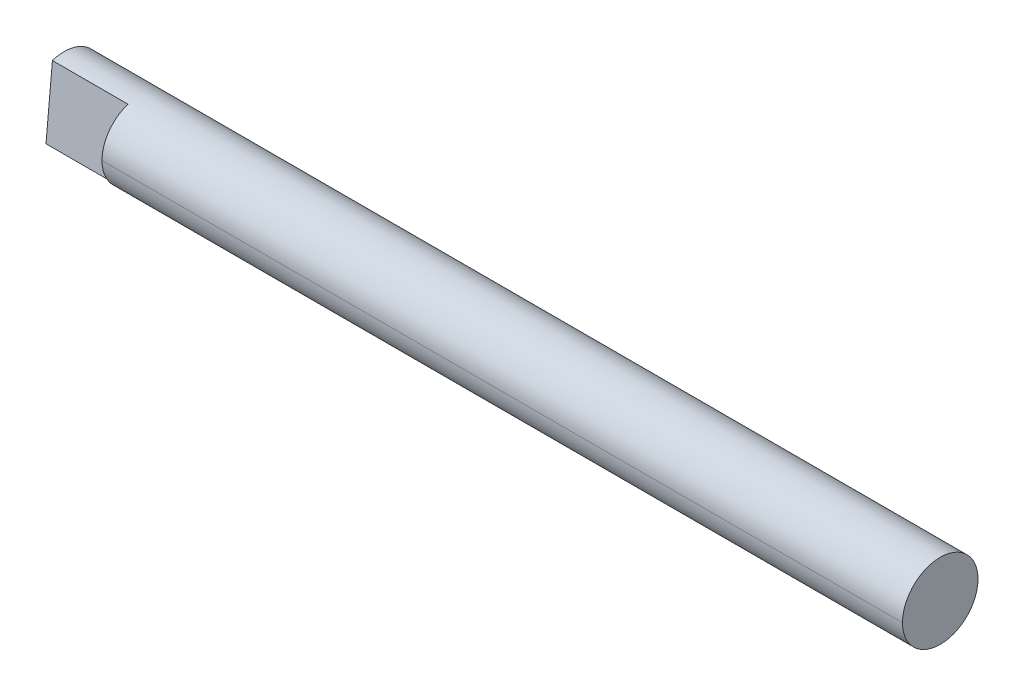
ISO-10303-21;
HEADER;
FILE_DESCRIPTION(('STEP AP214'),'2;1');
FILE_NAME('part.step','',(''),(''),'','','');
FILE_SCHEMA(('AUTOMOTIVE_DESIGN { 1 0 10303 214 1 1 1 1 }'));
ENDSEC;
DATA;
#1=APPLICATION_CONTEXT('core data for automotive mechanical design processes');
#2=APPLICATION_PROTOCOL_DEFINITION('international standard','automotive_design',2000,#1);
#3=PRODUCT_CONTEXT('',#1,'mechanical');
#4=PRODUCT('Part','Part','',(#3));
#5=PRODUCT_RELATED_PRODUCT_CATEGORY('part','',(#4));
#6=PRODUCT_DEFINITION_FORMATION('','',#4);
#7=PRODUCT_DEFINITION_CONTEXT('part definition',#1,'design');
#8=PRODUCT_DEFINITION('design','',#6,#7);
#9=PRODUCT_DEFINITION_SHAPE('','',#8);
#10=(LENGTH_UNIT() NAMED_UNIT(*) SI_UNIT(.MILLI.,.METRE.));
#11=(NAMED_UNIT(*) PLANE_ANGLE_UNIT() SI_UNIT($,.RADIAN.));
#12=(NAMED_UNIT(*) SI_UNIT($,.STERADIAN.) SOLID_ANGLE_UNIT());
#13=UNCERTAINTY_MEASURE_WITH_UNIT(LENGTH_MEASURE(1.E-05),#10,'distance_accuracy_value','');
#14=(GEOMETRIC_REPRESENTATION_CONTEXT(3) GLOBAL_UNCERTAINTY_ASSIGNED_CONTEXT((#13)) GLOBAL_UNIT_ASSIGNED_CONTEXT((#10,
#11,#12)) REPRESENTATION_CONTEXT('',''));
#15=CARTESIAN_POINT('',(0.,0.,0.));
#16=DIRECTION('',(0.,0.,1.));
#17=DIRECTION('',(1.,0.,0.));
#18=AXIS2_PLACEMENT_3D('',#15,#16,#17);
#19=CARTESIAN_POINT('',(600.,0.,0.));
#20=DIRECTION('',(1.,0.,0.));
#21=DIRECTION('',(0.,-1.,0.));
#22=AXIS2_PLACEMENT_3D('',#19,#20,#21);
#23=CYLINDRICAL_SURFACE('',#22,5.);
#24=DIRECTION('',(-1.,0.,0.));
#25=VECTOR('',#24,1.);
#26=CARTESIAN_POINT('',(10.,4.74769141742648,1.56825578426922));
#27=LINE('',#26,#25);
#28=CARTESIAN_POINT('',(10.,4.74769141742648,1.56825578426922));
#29=VERTEX_POINT('',#28);
#30=CARTESIAN_POINT('',(0.,4.74769141742658,1.56825578426926));
#31=VERTEX_POINT('',#30);
#32=EDGE_CURVE('E59',#29,#31,#27,.T.);
#33=ORIENTED_EDGE('',*,*,#32,.F.);
#34=CARTESIAN_POINT('',(10.,0.,0.));
#35=DIRECTION('',(-1.,0.,0.));
#36=DIRECTION('',(0.,0.,1.));
#37=AXIS2_PLACEMENT_3D('',#34,#35,#36);
#38=CIRCLE('',#37,5.);
#39=CARTESIAN_POINT('',(10.,0.,5.));
#40=VERTEX_POINT('',#39);
#41=EDGE_CURVE('E85',#40,#29,#38,.T.);
#42=ORIENTED_EDGE('',*,*,#41,.F.);
#43=DIRECTION('',(1.,0.,0.));
#44=VECTOR('',#43,1.);
#45=CARTESIAN_POINT('',(0.,0.,5.));
#46=LINE('',#45,#44);
#47=CARTESIAN_POINT('',(116.,0.,5.));
#48=VERTEX_POINT('',#47);
#49=EDGE_CURVE('E46',#40,#48,#46,.T.);
#50=ORIENTED_EDGE('',*,*,#49,.T.);
#51=CARTESIAN_POINT('',(116.,0.,0.));
#52=DIRECTION('',(1.,0.,0.));
#53=DIRECTION('',(0.,0.,-1.));
#54=AXIS2_PLACEMENT_3D('',#51,#52,#53);
#55=CIRCLE('',#54,5.);
#56=CARTESIAN_POINT('',(116.,0.,-5.));
#57=VERTEX_POINT('',#56);
#58=EDGE_CURVE('E104',#57,#48,#55,.T.);
#59=ORIENTED_EDGE('',*,*,#58,.F.);
#60=DIRECTION('',(1.,0.,0.));
#61=VECTOR('',#60,1.);
#62=CARTESIAN_POINT('',(0.,0.,-5.));
#63=LINE('',#62,#61);
#64=CARTESIAN_POINT('',(0.,0.,-5.));
#65=VERTEX_POINT('',#64);
#66=EDGE_CURVE('E106',#65,#57,#63,.T.);
#67=ORIENTED_EDGE('',*,*,#66,.F.);
#68=CARTESIAN_POINT('',(0.,0.,0.));
#69=DIRECTION('',(1.,0.,0.));
#70=DIRECTION('',(0.,0.,-1.));
#71=AXIS2_PLACEMENT_3D('',#68,#69,#70);
#72=CIRCLE('',#71,5.);
#73=EDGE_CURVE('E52',#65,#31,#72,.T.);
#74=ORIENTED_EDGE('',*,*,#73,.T.);
#75=EDGE_LOOP('',(#33,#42,#50,#59,#67,#74));
#76=FACE_BOUND('',#75,.T.);
#77=ADVANCED_FACE('F42',(#76),#23,.T.);
#78=CARTESIAN_POINT('',(600.,0.,0.));
#79=DIRECTION('',(1.,0.,0.));
#80=DIRECTION('',(0.,1.,0.));
#81=AXIS2_PLACEMENT_3D('',#78,#79,#80);
#82=CYLINDRICAL_SURFACE('',#81,5.);
#83=DIRECTION('',(-1.,0.,0.));
#84=VECTOR('',#83,1.);
#85=CARTESIAN_POINT('',(10.,-4.3782942983247,2.41465091416082));
#86=LINE('',#85,#84);
#87=CARTESIAN_POINT('',(10.,-4.3782942983247,2.41465091416082));
#88=VERTEX_POINT('',#87);
#89=CARTESIAN_POINT('',(0.,-4.3782942983247,2.41465091416082));
#90=VERTEX_POINT('',#89);
#91=EDGE_CURVE('E94',#88,#90,#86,.T.);
#92=ORIENTED_EDGE('',*,*,#91,.T.);
#93=CARTESIAN_POINT('',(0.,0.,0.));
#94=DIRECTION('',(1.,0.,0.));
#95=DIRECTION('',(0.,0.,-1.));
#96=AXIS2_PLACEMENT_3D('',#93,#94,#95);
#97=CIRCLE('',#96,5.);
#98=EDGE_CURVE('E11',#90,#65,#97,.T.);
#99=ORIENTED_EDGE('',*,*,#98,.T.);
#100=ORIENTED_EDGE('',*,*,#66,.T.);
#101=EDGE_CURVE('E100',#48,#57,#55,.T.);
#102=ORIENTED_EDGE('',*,*,#101,.F.);
#103=ORIENTED_EDGE('',*,*,#49,.F.);
#104=EDGE_CURVE('E89',#88,#40,#38,.T.);
#105=ORIENTED_EDGE('',*,*,#104,.F.);
#106=EDGE_LOOP('',(#92,#99,#100,#102,#103,#105));
#107=FACE_BOUND('',#106,.T.);
#108=ADVANCED_FACE('F118',(#107),#82,.T.);
#109=CARTESIAN_POINT('',(0.,0.,0.));
#110=DIRECTION('',(1.,0.,0.));
#111=DIRECTION('',(0.,0.,-1.));
#112=AXIS2_PLACEMENT_3D('',#109,#110,#111);
#113=PLANE('',#112);
#114=ORIENTED_EDGE('',*,*,#98,.F.);
#115=DIRECTION('',(0.,-0.995726674607521,0.0923492797754743));
#116=VECTOR('',#115,1.);
#117=CARTESIAN_POINT('',(0.,0.184698559550944,1.99145334921502));
#118=LINE('',#117,#116);
#119=EDGE_CURVE('E90',#31,#90,#118,.T.);
#120=ORIENTED_EDGE('',*,*,#119,.F.);
#121=ORIENTED_EDGE('',*,*,#73,.F.);
#122=EDGE_LOOP('',(#114,#120,#121));
#123=FACE_BOUND('',#122,.T.);
#124=ADVANCED_FACE('F44',(#123),#113,.F.);
#125=CARTESIAN_POINT('',(116.,0.,0.));
#126=DIRECTION('',(1.,0.,0.));
#127=DIRECTION('',(0.,0.,-1.));
#128=AXIS2_PLACEMENT_3D('',#125,#126,#127);
#129=PLANE('',#128);
#130=ORIENTED_EDGE('',*,*,#58,.T.);
#131=ORIENTED_EDGE('',*,*,#101,.T.);
#132=EDGE_LOOP('',(#130,#131));
#133=FACE_BOUND('',#132,.T.);
#134=ADVANCED_FACE('F121',(#133),#129,.T.);
#135=CARTESIAN_POINT('',(10.,0.184698559550944,1.99145334921502));
#136=DIRECTION('',(0.,-0.0923492797754743,-0.995726674607521));
#137=DIRECTION('',(0.,0.995726674607521,-0.0923492797754743));
#138=AXIS2_PLACEMENT_3D('',#135,#136,#137);
#139=PLANE('',#138);
#140=ORIENTED_EDGE('',*,*,#119,.T.);
#141=ORIENTED_EDGE('',*,*,#91,.F.);
#142=DIRECTION('',(0.,-0.995726674607521,0.0923492797754743));
#143=VECTOR('',#142,1.);
#144=CARTESIAN_POINT('',(10.,0.184698559550944,1.99145334921502));
#145=LINE('',#144,#143);
#146=EDGE_CURVE('E87',#29,#88,#145,.T.);
#147=ORIENTED_EDGE('',*,*,#146,.F.);
#148=ORIENTED_EDGE('',*,*,#32,.T.);
#149=EDGE_LOOP('',(#140,#141,#147,#148));
#150=FACE_BOUND('',#149,.T.);
#151=ADVANCED_FACE('F92',(#150),#139,.F.);
#152=CARTESIAN_POINT('',(10.,0.,0.));
#153=DIRECTION('',(-1.,0.,0.));
#154=DIRECTION('',(0.,0.,1.));
#155=AXIS2_PLACEMENT_3D('',#152,#153,#154);
#156=PLANE('',#155);
#157=ORIENTED_EDGE('',*,*,#104,.T.);
#158=ORIENTED_EDGE('',*,*,#41,.T.);
#159=ORIENTED_EDGE('',*,*,#146,.T.);
#160=EDGE_LOOP('',(#157,#158,#159));
#161=FACE_BOUND('',#160,.T.);
#162=ADVANCED_FACE('F86',(#161),#156,.T.);
#163=CLOSED_SHELL('',(#77,#108,#124,#134,#151,#162));
#164=MANIFOLD_SOLID_BREP('B2',#163);
#165=ADVANCED_BREP_SHAPE_REPRESENTATION('',(#18,#164),#14);
#166=SHAPE_DEFINITION_REPRESENTATION(#9,#165);
ENDSEC;
END-ISO-10303-21;
